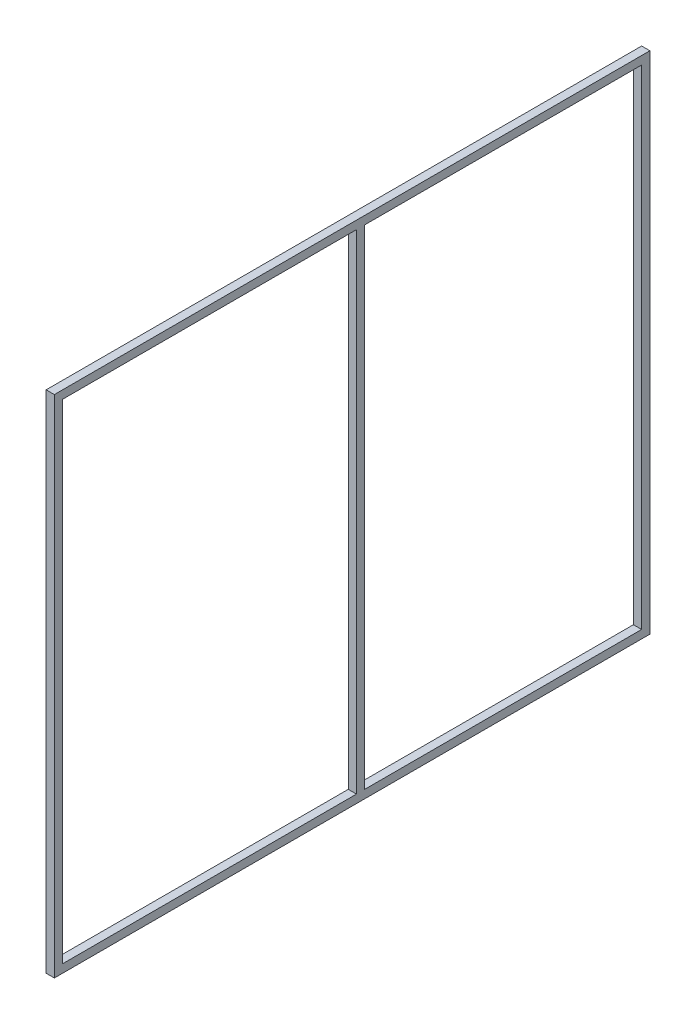
ISO-10303-21;
HEADER;
FILE_DESCRIPTION(('STEP AP214'),'2;1');
FILE_NAME('part.step','',(''),(''),'','','');
FILE_SCHEMA(('AUTOMOTIVE_DESIGN { 1 0 10303 214 1 1 1 1 }'));
ENDSEC;
DATA;
#1=APPLICATION_CONTEXT('core data for automotive mechanical design processes');
#2=APPLICATION_PROTOCOL_DEFINITION('international standard','automotive_design',2000,#1);
#3=PRODUCT_CONTEXT('',#1,'mechanical');
#4=PRODUCT('Part','Part','',(#3));
#5=PRODUCT_RELATED_PRODUCT_CATEGORY('part','',(#4));
#6=PRODUCT_DEFINITION_FORMATION('','',#4);
#7=PRODUCT_DEFINITION_CONTEXT('part definition',#1,'design');
#8=PRODUCT_DEFINITION('design','',#6,#7);
#9=PRODUCT_DEFINITION_SHAPE('','',#8);
#10=(LENGTH_UNIT() NAMED_UNIT(*) SI_UNIT(.MILLI.,.METRE.));
#11=(NAMED_UNIT(*) PLANE_ANGLE_UNIT() SI_UNIT($,.RADIAN.));
#12=(NAMED_UNIT(*) SI_UNIT($,.STERADIAN.) SOLID_ANGLE_UNIT());
#13=UNCERTAINTY_MEASURE_WITH_UNIT(LENGTH_MEASURE(1.E-05),#10,'distance_accuracy_value','');
#14=(GEOMETRIC_REPRESENTATION_CONTEXT(3) GLOBAL_UNCERTAINTY_ASSIGNED_CONTEXT((#13)) GLOBAL_UNIT_ASSIGNED_CONTEXT((#10,
#11,#12)) REPRESENTATION_CONTEXT('',''));
#15=CARTESIAN_POINT('',(0.,0.,0.));
#16=DIRECTION('',(0.,0.,1.));
#17=DIRECTION('',(1.,0.,0.));
#18=AXIS2_PLACEMENT_3D('',#15,#16,#17);
#19=CARTESIAN_POINT('',(15.875,-472.0175,559.125));
#20=DIRECTION('',(0.,1.,0.));
#21=DIRECTION('',(0.,0.,1.));
#22=AXIS2_PLACEMENT_3D('',#19,#20,#21);
#23=PLANE('',#22);
#24=DIRECTION('',(0.,0.,-1.));
#25=VECTOR('',#24,1.);
#26=CARTESIAN_POINT('',(15.875,-472.0175,559.125));
#27=LINE('',#26,#25);
#28=CARTESIAN_POINT('',(15.875,-472.0175,559.125));
#29=VERTEX_POINT('',#28);
#30=CARTESIAN_POINT('',(15.875,-472.0175,-8.43750000000501));
#31=VERTEX_POINT('',#30);
#32=EDGE_CURVE('E145',#29,#31,#27,.T.);
#33=ORIENTED_EDGE('',*,*,#32,.T.);
#34=DIRECTION('',(1.,0.,0.));
#35=VECTOR('',#34,1.);
#36=CARTESIAN_POINT('',(15.875,-472.0175,-8.43750000000501));
#37=LINE('',#36,#35);
#38=CARTESIAN_POINT('',(0.,-472.0175,-8.43750000000498));
#39=VERTEX_POINT('',#38);
#40=EDGE_CURVE('E139',#39,#31,#37,.T.);
#41=ORIENTED_EDGE('',*,*,#40,.F.);
#42=DIRECTION('',(0.,0.,-1.));
#43=VECTOR('',#42,1.);
#44=CARTESIAN_POINT('',(0.,-472.0175,559.125));
#45=LINE('',#44,#43);
#46=CARTESIAN_POINT('',(0.,-472.0175,559.125));
#47=VERTEX_POINT('',#46);
#48=EDGE_CURVE('E162',#47,#39,#45,.T.);
#49=ORIENTED_EDGE('',*,*,#48,.F.);
#50=DIRECTION('',(-1.,0.,0.));
#51=VECTOR('',#50,1.);
#52=CARTESIAN_POINT('',(15.875,-472.0175,559.125));
#53=LINE('',#52,#51);
#54=EDGE_CURVE('E161',#29,#47,#53,.T.);
#55=ORIENTED_EDGE('',*,*,#54,.F.);
#56=EDGE_LOOP('',(#33,#41,#49,#55));
#57=FACE_BOUND('',#56,.T.);
#58=ADVANCED_FACE('F33',(#57),#23,.T.);
#59=CARTESIAN_POINT('',(0.,-472.0175,-24.312500000005));
#60=VERTEX_POINT('',#59);
#61=CARTESIAN_POINT('',(0.,-472.0175,-559.125));
#62=VERTEX_POINT('',#61);
#63=EDGE_CURVE('E137',#60,#62,#45,.T.);
#64=ORIENTED_EDGE('',*,*,#63,.F.);
#65=DIRECTION('',(-1.,0.,0.));
#66=VECTOR('',#65,1.);
#67=CARTESIAN_POINT('',(15.875,-472.0175,-24.3125000000051));
#68=LINE('',#67,#66);
#69=CARTESIAN_POINT('',(15.875,-472.0175,-24.3125000000051));
#70=VERTEX_POINT('',#69);
#71=EDGE_CURVE('E48',#70,#60,#68,.T.);
#72=ORIENTED_EDGE('',*,*,#71,.F.);
#73=CARTESIAN_POINT('',(15.875,-472.0175,-559.125));
#74=VERTEX_POINT('',#73);
#75=EDGE_CURVE('E135',#70,#74,#27,.T.);
#76=ORIENTED_EDGE('',*,*,#75,.T.);
#77=DIRECTION('',(-1.,0.,0.));
#78=VECTOR('',#77,1.);
#79=CARTESIAN_POINT('',(15.875,-472.0175,-559.125));
#80=LINE('',#79,#78);
#81=EDGE_CURVE('E177',#74,#62,#80,.T.);
#82=ORIENTED_EDGE('',*,*,#81,.T.);
#83=EDGE_LOOP('',(#64,#72,#76,#82));
#84=FACE_BOUND('',#83,.T.);
#85=ADVANCED_FACE('F133',(#84),#23,.T.);
#86=CARTESIAN_POINT('',(15.875,472.0175,559.125));
#87=DIRECTION('',(0.,-1.,0.));
#88=DIRECTION('',(0.,0.,-1.));
#89=AXIS2_PLACEMENT_3D('',#86,#87,#88);
#90=PLANE('',#89);
#91=DIRECTION('',(0.,0.,1.));
#92=VECTOR('',#91,1.);
#93=CARTESIAN_POINT('',(0.,472.0175,559.125));
#94=LINE('',#93,#92);
#95=CARTESIAN_POINT('',(0.,472.0175,-8.43750000000498));
#96=VERTEX_POINT('',#95);
#97=CARTESIAN_POINT('',(0.,472.0175,559.125));
#98=VERTEX_POINT('',#97);
#99=EDGE_CURVE('E167',#96,#98,#94,.T.);
#100=ORIENTED_EDGE('',*,*,#99,.F.);
#101=DIRECTION('',(-1.,0.,0.));
#102=VECTOR('',#101,1.);
#103=CARTESIAN_POINT('',(15.875,472.0175,-8.43750000000501));
#104=LINE('',#103,#102);
#105=CARTESIAN_POINT('',(15.875,472.0175,-8.43750000000501));
#106=VERTEX_POINT('',#105);
#107=EDGE_CURVE('E128',#106,#96,#104,.T.);
#108=ORIENTED_EDGE('',*,*,#107,.F.);
#109=DIRECTION('',(0.,0.,1.));
#110=VECTOR('',#109,1.);
#111=CARTESIAN_POINT('',(15.875,472.0175,559.125));
#112=LINE('',#111,#110);
#113=CARTESIAN_POINT('',(15.875,472.0175,559.125));
#114=VERTEX_POINT('',#113);
#115=EDGE_CURVE('E156',#106,#114,#112,.T.);
#116=ORIENTED_EDGE('',*,*,#115,.T.);
#117=DIRECTION('',(-1.,0.,0.));
#118=VECTOR('',#117,1.);
#119=CARTESIAN_POINT('',(15.875,472.0175,559.125));
#120=LINE('',#119,#118);
#121=EDGE_CURVE('E172',#114,#98,#120,.T.);
#122=ORIENTED_EDGE('',*,*,#121,.T.);
#123=EDGE_LOOP('',(#100,#108,#116,#122));
#124=FACE_BOUND('',#123,.T.);
#125=ADVANCED_FACE('F236',(#124),#90,.T.);
#126=CARTESIAN_POINT('',(15.875,472.0175,-559.125));
#127=VERTEX_POINT('',#126);
#128=CARTESIAN_POINT('',(15.875,472.0175,-24.3125000000051));
#129=VERTEX_POINT('',#128);
#130=EDGE_CURVE('E157',#127,#129,#112,.T.);
#131=ORIENTED_EDGE('',*,*,#130,.T.);
#132=DIRECTION('',(1.,0.,0.));
#133=VECTOR('',#132,1.);
#134=CARTESIAN_POINT('',(15.875,472.0175,-24.3125000000051));
#135=LINE('',#134,#133);
#136=CARTESIAN_POINT('',(0.,472.0175,-24.312500000005));
#137=VERTEX_POINT('',#136);
#138=EDGE_CURVE('E123',#137,#129,#135,.T.);
#139=ORIENTED_EDGE('',*,*,#138,.F.);
#140=CARTESIAN_POINT('',(0.,472.0175,-559.125));
#141=VERTEX_POINT('',#140);
#142=EDGE_CURVE('E150',#141,#137,#94,.T.);
#143=ORIENTED_EDGE('',*,*,#142,.F.);
#144=DIRECTION('',(-1.,0.,0.));
#145=VECTOR('',#144,1.);
#146=CARTESIAN_POINT('',(15.875,472.0175,-559.125));
#147=LINE('',#146,#145);
#148=EDGE_CURVE('E175',#127,#141,#147,.T.);
#149=ORIENTED_EDGE('',*,*,#148,.F.);
#150=EDGE_LOOP('',(#131,#139,#143,#149));
#151=FACE_BOUND('',#150,.T.);
#152=ADVANCED_FACE('F243',(#151),#90,.T.);
#153=CARTESIAN_POINT('',(15.875,0.,0.));
#154=DIRECTION('',(-1.,0.,0.));
#155=DIRECTION('',(0.,0.,1.));
#156=AXIS2_PLACEMENT_3D('',#153,#154,#155);
#157=PLANE('',#156);
#158=ORIENTED_EDGE('',*,*,#75,.F.);
#159=DIRECTION('',(0.,-1.,0.));
#160=VECTOR('',#159,1.);
#161=CARTESIAN_POINT('',(15.875,487.8945,-24.3125000000051));
#162=LINE('',#161,#160);
#163=EDGE_CURVE('E120',#129,#70,#162,.T.);
#164=ORIENTED_EDGE('',*,*,#163,.F.);
#165=ORIENTED_EDGE('',*,*,#130,.F.);
#166=DIRECTION('',(0.,1.,0.));
#167=VECTOR('',#166,1.);
#168=CARTESIAN_POINT('',(15.875,-472.0175,-559.125));
#169=LINE('',#168,#167);
#170=EDGE_CURVE('E144',#74,#127,#169,.T.);
#171=ORIENTED_EDGE('',*,*,#170,.F.);
#172=EDGE_LOOP('',(#158,#164,#165,#171));
#173=FACE_BOUND('',#172,.T.);
#174=DIRECTION('',(0.,1.,0.));
#175=VECTOR('',#174,1.);
#176=CARTESIAN_POINT('',(15.875,-487.8925,-575.));
#177=LINE('',#176,#175);
#178=CARTESIAN_POINT('',(15.875,-487.8925,-575.));
#179=VERTEX_POINT('',#178);
#180=CARTESIAN_POINT('',(15.875,487.8925,-575.));
#181=VERTEX_POINT('',#180);
#182=EDGE_CURVE('E180',#179,#181,#177,.T.);
#183=ORIENTED_EDGE('',*,*,#182,.T.);
#184=DIRECTION('',(0.,0.,1.));
#185=VECTOR('',#184,1.);
#186=CARTESIAN_POINT('',(15.875,487.8925,575.));
#187=LINE('',#186,#185);
#188=CARTESIAN_POINT('',(15.875,487.8925,575.));
#189=VERTEX_POINT('',#188);
#190=EDGE_CURVE('E183',#181,#189,#187,.T.);
#191=ORIENTED_EDGE('',*,*,#190,.T.);
#192=DIRECTION('',(0.,-1.,0.));
#193=VECTOR('',#192,1.);
#194=CARTESIAN_POINT('',(15.875,-487.8925,575.));
#195=LINE('',#194,#193);
#196=CARTESIAN_POINT('',(15.875,-487.8925,575.));
#197=VERTEX_POINT('',#196);
#198=EDGE_CURVE('E186',#189,#197,#195,.T.);
#199=ORIENTED_EDGE('',*,*,#198,.T.);
#200=DIRECTION('',(0.,0.,-1.));
#201=VECTOR('',#200,1.);
#202=CARTESIAN_POINT('',(15.875,-487.8925,575.));
#203=LINE('',#202,#201);
#204=EDGE_CURVE('E188',#197,#179,#203,.T.);
#205=ORIENTED_EDGE('',*,*,#204,.T.);
#206=EDGE_LOOP('',(#183,#191,#199,#205));
#207=FACE_BOUND('',#206,.T.);
#208=ORIENTED_EDGE('',*,*,#32,.F.);
#209=DIRECTION('',(0.,-1.,0.));
#210=VECTOR('',#209,1.);
#211=CARTESIAN_POINT('',(15.875,-472.0175,559.125));
#212=LINE('',#211,#210);
#213=EDGE_CURVE('E159',#114,#29,#212,.T.);
#214=ORIENTED_EDGE('',*,*,#213,.F.);
#215=ORIENTED_EDGE('',*,*,#115,.F.);
#216=DIRECTION('',(0.,-1.,0.));
#217=VECTOR('',#216,1.);
#218=CARTESIAN_POINT('',(15.875,487.8945,-8.43750000000501));
#219=LINE('',#218,#217);
#220=EDGE_CURVE('E138',#106,#31,#219,.T.);
#221=ORIENTED_EDGE('',*,*,#220,.T.);
#222=EDGE_LOOP('',(#208,#214,#215,#221));
#223=FACE_BOUND('',#222,.T.);
#224=ADVANCED_FACE('F142',(#173,#207,#223),#157,.F.);
#225=CARTESIAN_POINT('',(0.,0.,0.));
#226=DIRECTION('',(-1.,0.,0.));
#227=DIRECTION('',(0.,0.,1.));
#228=AXIS2_PLACEMENT_3D('',#225,#226,#227);
#229=PLANE('',#228);
#230=ORIENTED_EDGE('',*,*,#48,.T.);
#231=DIRECTION('',(0.,-1.,0.));
#232=VECTOR('',#231,1.);
#233=CARTESIAN_POINT('',(0.,487.8945,-8.43750000000498));
#234=LINE('',#233,#232);
#235=EDGE_CURVE('E56',#96,#39,#234,.T.);
#236=ORIENTED_EDGE('',*,*,#235,.F.);
#237=ORIENTED_EDGE('',*,*,#99,.T.);
#238=DIRECTION('',(0.,-1.,0.));
#239=VECTOR('',#238,1.);
#240=CARTESIAN_POINT('',(0.,-472.0175,559.125));
#241=LINE('',#240,#239);
#242=EDGE_CURVE('E146',#98,#47,#241,.T.);
#243=ORIENTED_EDGE('',*,*,#242,.T.);
#244=EDGE_LOOP('',(#230,#236,#237,#243));
#245=FACE_BOUND('',#244,.T.);
#246=DIRECTION('',(0.,1.,0.));
#247=VECTOR('',#246,1.);
#248=CARTESIAN_POINT('',(0.,-487.8925,-575.));
#249=LINE('',#248,#247);
#250=CARTESIAN_POINT('',(0.,-487.8925,-575.));
#251=VERTEX_POINT('',#250);
#252=CARTESIAN_POINT('',(0.,487.8925,-575.));
#253=VERTEX_POINT('',#252);
#254=EDGE_CURVE('E179',#251,#253,#249,.T.);
#255=ORIENTED_EDGE('',*,*,#254,.F.);
#256=DIRECTION('',(0.,0.,-1.));
#257=VECTOR('',#256,1.);
#258=CARTESIAN_POINT('',(0.,-487.8925,-559.125));
#259=LINE('',#258,#257);
#260=CARTESIAN_POINT('',(0.,-487.8925,575.));
#261=VERTEX_POINT('',#260);
#262=EDGE_CURVE('E184',#261,#251,#259,.T.);
#263=ORIENTED_EDGE('',*,*,#262,.F.);
#264=DIRECTION('',(0.,-1.,0.));
#265=VECTOR('',#264,1.);
#266=CARTESIAN_POINT('',(0.,-487.8925,575.));
#267=LINE('',#266,#265);
#268=CARTESIAN_POINT('',(0.,487.8925,575.));
#269=VERTEX_POINT('',#268);
#270=EDGE_CURVE('E195',#269,#261,#267,.T.);
#271=ORIENTED_EDGE('',*,*,#270,.F.);
#272=DIRECTION('',(0.,0.,1.));
#273=VECTOR('',#272,1.);
#274=CARTESIAN_POINT('',(0.,487.8925,575.));
#275=LINE('',#274,#273);
#276=EDGE_CURVE('E193',#253,#269,#275,.T.);
#277=ORIENTED_EDGE('',*,*,#276,.F.);
#278=EDGE_LOOP('',(#255,#263,#271,#277));
#279=FACE_BOUND('',#278,.T.);
#280=DIRECTION('',(0.,-1.,0.));
#281=VECTOR('',#280,1.);
#282=CARTESIAN_POINT('',(0.,487.8945,-24.312500000005));
#283=LINE('',#282,#281);
#284=EDGE_CURVE('E129',#137,#60,#283,.T.);
#285=ORIENTED_EDGE('',*,*,#284,.T.);
#286=ORIENTED_EDGE('',*,*,#63,.T.);
#287=DIRECTION('',(0.,1.,0.));
#288=VECTOR('',#287,1.);
#289=CARTESIAN_POINT('',(0.,-472.0175,-559.125));
#290=LINE('',#289,#288);
#291=EDGE_CURVE('E164',#62,#141,#290,.T.);
#292=ORIENTED_EDGE('',*,*,#291,.T.);
#293=ORIENTED_EDGE('',*,*,#142,.T.);
#294=EDGE_LOOP('',(#285,#286,#292,#293));
#295=FACE_BOUND('',#294,.T.);
#296=ADVANCED_FACE('F213',(#245,#279,#295),#229,.T.);
#297=CARTESIAN_POINT('',(15.875,-487.8925,-575.));
#298=DIRECTION('',(0.,0.,1.));
#299=DIRECTION('',(1.,0.,0.));
#300=AXIS2_PLACEMENT_3D('',#297,#298,#299);
#301=PLANE('',#300);
#302=ORIENTED_EDGE('',*,*,#254,.T.);
#303=DIRECTION('',(-1.,0.,0.));
#304=VECTOR('',#303,1.);
#305=CARTESIAN_POINT('',(15.875,487.8925,-575.));
#306=LINE('',#305,#304);
#307=EDGE_CURVE('E11',#181,#253,#306,.T.);
#308=ORIENTED_EDGE('',*,*,#307,.F.);
#309=ORIENTED_EDGE('',*,*,#182,.F.);
#310=DIRECTION('',(-1.,0.,0.));
#311=VECTOR('',#310,1.);
#312=CARTESIAN_POINT('',(15.875,-487.8925,-575.));
#313=LINE('',#312,#311);
#314=EDGE_CURVE('E190',#179,#251,#313,.T.);
#315=ORIENTED_EDGE('',*,*,#314,.T.);
#316=EDGE_LOOP('',(#302,#308,#309,#315));
#317=FACE_BOUND('',#316,.T.);
#318=ADVANCED_FACE('F35',(#317),#301,.F.);
#319=CARTESIAN_POINT('',(15.875,487.8925,575.));
#320=DIRECTION('',(0.,-1.,0.));
#321=DIRECTION('',(0.,0.,-1.));
#322=AXIS2_PLACEMENT_3D('',#319,#320,#321);
#323=PLANE('',#322);
#324=ORIENTED_EDGE('',*,*,#276,.T.);
#325=DIRECTION('',(-1.,0.,0.));
#326=VECTOR('',#325,1.);
#327=CARTESIAN_POINT('',(15.875,487.8925,575.));
#328=LINE('',#327,#326);
#329=EDGE_CURVE('E41',#189,#269,#328,.T.);
#330=ORIENTED_EDGE('',*,*,#329,.F.);
#331=ORIENTED_EDGE('',*,*,#190,.F.);
#332=ORIENTED_EDGE('',*,*,#307,.T.);
#333=EDGE_LOOP('',(#324,#330,#331,#332));
#334=FACE_BOUND('',#333,.T.);
#335=ADVANCED_FACE('F223',(#334),#323,.F.);
#336=CARTESIAN_POINT('',(15.875,-487.8925,575.));
#337=DIRECTION('',(0.,0.,-1.));
#338=DIRECTION('',(-1.,0.,0.));
#339=AXIS2_PLACEMENT_3D('',#336,#337,#338);
#340=PLANE('',#339);
#341=ORIENTED_EDGE('',*,*,#270,.T.);
#342=DIRECTION('',(-1.,0.,0.));
#343=VECTOR('',#342,1.);
#344=CARTESIAN_POINT('',(15.875,-487.8925,575.));
#345=LINE('',#344,#343);
#346=EDGE_CURVE('E201',#197,#261,#345,.T.);
#347=ORIENTED_EDGE('',*,*,#346,.F.);
#348=ORIENTED_EDGE('',*,*,#198,.F.);
#349=ORIENTED_EDGE('',*,*,#329,.T.);
#350=EDGE_LOOP('',(#341,#347,#348,#349));
#351=FACE_BOUND('',#350,.T.);
#352=ADVANCED_FACE('F208',(#351),#340,.F.);
#353=CARTESIAN_POINT('',(15.875,-487.8925,-559.125));
#354=DIRECTION('',(0.,1.,0.));
#355=DIRECTION('',(0.,0.,1.));
#356=AXIS2_PLACEMENT_3D('',#353,#354,#355);
#357=PLANE('',#356);
#358=ORIENTED_EDGE('',*,*,#262,.T.);
#359=ORIENTED_EDGE('',*,*,#314,.F.);
#360=ORIENTED_EDGE('',*,*,#204,.F.);
#361=ORIENTED_EDGE('',*,*,#346,.T.);
#362=EDGE_LOOP('',(#358,#359,#360,#361));
#363=FACE_BOUND('',#362,.T.);
#364=ADVANCED_FACE('F217',(#363),#357,.F.);
#365=CARTESIAN_POINT('',(15.875,-472.0175,-559.125));
#366=DIRECTION('',(0.,0.,1.));
#367=DIRECTION('',(1.,0.,0.));
#368=AXIS2_PLACEMENT_3D('',#365,#366,#367);
#369=PLANE('',#368);
#370=ORIENTED_EDGE('',*,*,#291,.F.);
#371=ORIENTED_EDGE('',*,*,#81,.F.);
#372=ORIENTED_EDGE('',*,*,#170,.T.);
#373=ORIENTED_EDGE('',*,*,#148,.T.);
#374=EDGE_LOOP('',(#370,#371,#372,#373));
#375=FACE_BOUND('',#374,.T.);
#376=ADVANCED_FACE('F239',(#375),#369,.T.);
#377=CARTESIAN_POINT('',(15.875,-472.0175,559.125));
#378=DIRECTION('',(0.,0.,-1.));
#379=DIRECTION('',(0.,1.,0.));
#380=AXIS2_PLACEMENT_3D('',#377,#378,#379);
#381=PLANE('',#380);
#382=ORIENTED_EDGE('',*,*,#242,.F.);
#383=ORIENTED_EDGE('',*,*,#121,.F.);
#384=ORIENTED_EDGE('',*,*,#213,.T.);
#385=ORIENTED_EDGE('',*,*,#54,.T.);
#386=EDGE_LOOP('',(#382,#383,#384,#385));
#387=FACE_BOUND('',#386,.T.);
#388=ADVANCED_FACE('F250',(#387),#381,.T.);
#389=CARTESIAN_POINT('',(15.875,487.8945,-8.43750000000501));
#390=DIRECTION('',(0.,0.,-1.));
#391=DIRECTION('',(-1.,0.,0.));
#392=AXIS2_PLACEMENT_3D('',#389,#390,#391);
#393=PLANE('',#392);
#394=ORIENTED_EDGE('',*,*,#220,.F.);
#395=ORIENTED_EDGE('',*,*,#107,.T.);
#396=ORIENTED_EDGE('',*,*,#235,.T.);
#397=ORIENTED_EDGE('',*,*,#40,.T.);
#398=EDGE_LOOP('',(#394,#395,#396,#397));
#399=FACE_BOUND('',#398,.T.);
#400=ADVANCED_FACE('F255',(#399),#393,.F.);
#401=CARTESIAN_POINT('',(15.875,487.8945,-24.3125000000051));
#402=DIRECTION('',(0.,0.,1.));
#403=DIRECTION('',(1.,0.,0.));
#404=AXIS2_PLACEMENT_3D('',#401,#402,#403);
#405=PLANE('',#404);
#406=ORIENTED_EDGE('',*,*,#284,.F.);
#407=ORIENTED_EDGE('',*,*,#138,.T.);
#408=ORIENTED_EDGE('',*,*,#163,.T.);
#409=ORIENTED_EDGE('',*,*,#71,.T.);
#410=EDGE_LOOP('',(#406,#407,#408,#409));
#411=FACE_BOUND('',#410,.T.);
#412=ADVANCED_FACE('F121',(#411),#405,.F.);
#413=CLOSED_SHELL('',(#58,#85,#125,#152,#224,#296,#318,#335,#352,#364,#376,#388,#400,#412));
#414=MANIFOLD_SOLID_BREP('B2',#413);
#415=ADVANCED_BREP_SHAPE_REPRESENTATION('',(#18,#414),#14);
#416=SHAPE_DEFINITION_REPRESENTATION(#9,#415);
ENDSEC;
END-ISO-10303-21;
